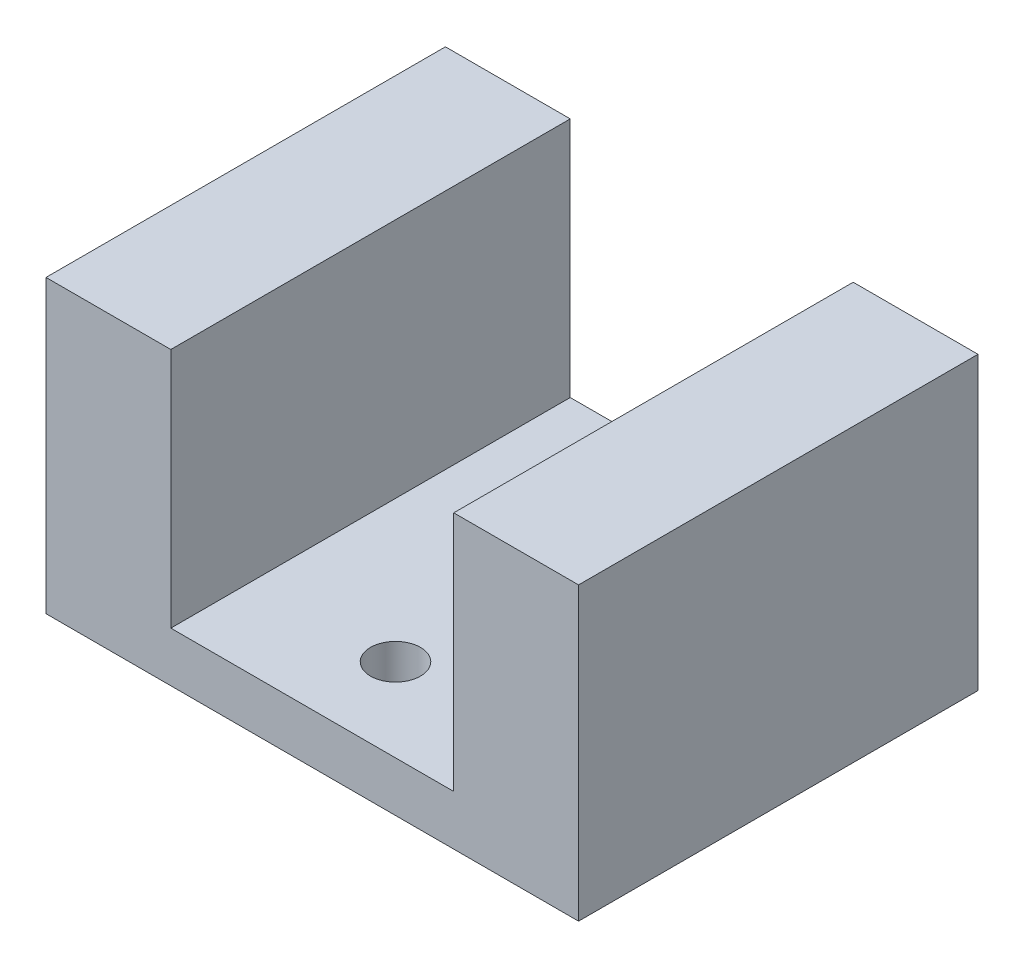
ISO-10303-21;
HEADER;
FILE_DESCRIPTION(('STEP AP214'),'2;1');
FILE_NAME('part.step','',(''),(''),'','','');
FILE_SCHEMA(('AUTOMOTIVE_DESIGN { 1 0 10303 214 1 1 1 1 }'));
ENDSEC;
DATA;
#1=APPLICATION_CONTEXT('core data for automotive mechanical design processes');
#2=APPLICATION_PROTOCOL_DEFINITION('international standard','automotive_design',2000,#1);
#3=PRODUCT_CONTEXT('',#1,'mechanical');
#4=PRODUCT('Part','Part','',(#3));
#5=PRODUCT_RELATED_PRODUCT_CATEGORY('part','',(#4));
#6=PRODUCT_DEFINITION_FORMATION('','',#4);
#7=PRODUCT_DEFINITION_CONTEXT('part definition',#1,'design');
#8=PRODUCT_DEFINITION('design','',#6,#7);
#9=PRODUCT_DEFINITION_SHAPE('','',#8);
#10=(LENGTH_UNIT() NAMED_UNIT(*) SI_UNIT(.MILLI.,.METRE.));
#11=(NAMED_UNIT(*) PLANE_ANGLE_UNIT() SI_UNIT($,.RADIAN.));
#12=(NAMED_UNIT(*) SI_UNIT($,.STERADIAN.) SOLID_ANGLE_UNIT());
#13=UNCERTAINTY_MEASURE_WITH_UNIT(LENGTH_MEASURE(1.E-05),#10,'distance_accuracy_value','');
#14=(GEOMETRIC_REPRESENTATION_CONTEXT(3) GLOBAL_UNCERTAINTY_ASSIGNED_CONTEXT((#13)) GLOBAL_UNIT_ASSIGNED_CONTEXT((#10,
#11,#12)) REPRESENTATION_CONTEXT('',''));
#15=CARTESIAN_POINT('',(0.,0.,0.));
#16=DIRECTION('',(0.,0.,1.));
#17=DIRECTION('',(1.,0.,0.));
#18=AXIS2_PLACEMENT_3D('',#15,#16,#17);
#19=CARTESIAN_POINT('',(-8.5,17.5,24.));
#20=DIRECTION('',(0.,-1.,0.));
#21=DIRECTION('',(1.,0.,0.));
#22=AXIS2_PLACEMENT_3D('',#19,#20,#21);
#23=PLANE('',#22);
#24=DIRECTION('',(-1.,0.,0.));
#25=VECTOR('',#24,1.);
#26=CARTESIAN_POINT('',(-8.5,17.5,0.));
#27=LINE('',#26,#25);
#28=CARTESIAN_POINT('',(-8.5,17.5,0.));
#29=VERTEX_POINT('',#28);
#30=CARTESIAN_POINT('',(-16.,17.5,0.));
#31=VERTEX_POINT('',#30);
#32=EDGE_CURVE('E129',#29,#31,#27,.T.);
#33=ORIENTED_EDGE('',*,*,#32,.T.);
#34=DIRECTION('',(0.,0.,-1.));
#35=VECTOR('',#34,1.);
#36=CARTESIAN_POINT('',(-16.,17.5,24.));
#37=LINE('',#36,#35);
#38=CARTESIAN_POINT('',(-16.,17.5,24.));
#39=VERTEX_POINT('',#38);
#40=EDGE_CURVE('E11',#39,#31,#37,.T.);
#41=ORIENTED_EDGE('',*,*,#40,.F.);
#42=DIRECTION('',(-1.,0.,0.));
#43=VECTOR('',#42,1.);
#44=CARTESIAN_POINT('',(-8.5,17.5,24.));
#45=LINE('',#44,#43);
#46=CARTESIAN_POINT('',(-8.5,17.5,24.));
#47=VERTEX_POINT('',#46);
#48=EDGE_CURVE('E144',#47,#39,#45,.T.);
#49=ORIENTED_EDGE('',*,*,#48,.F.);
#50=DIRECTION('',(0.,0.,-1.));
#51=VECTOR('',#50,1.);
#52=CARTESIAN_POINT('',(-8.5,17.5,24.));
#53=LINE('',#52,#51);
#54=EDGE_CURVE('E125',#47,#29,#53,.T.);
#55=ORIENTED_EDGE('',*,*,#54,.T.);
#56=EDGE_LOOP('',(#33,#41,#49,#55));
#57=FACE_BOUND('',#56,.T.);
#58=ADVANCED_FACE('F33',(#57),#23,.F.);
#59=CARTESIAN_POINT('',(-16.,17.5,24.));
#60=DIRECTION('',(1.,0.,0.));
#61=DIRECTION('',(0.,1.,0.));
#62=AXIS2_PLACEMENT_3D('',#59,#60,#61);
#63=PLANE('',#62);
#64=DIRECTION('',(0.,-1.,0.));
#65=VECTOR('',#64,1.);
#66=CARTESIAN_POINT('',(-16.,17.5,0.));
#67=LINE('',#66,#65);
#68=CARTESIAN_POINT('',(-16.,0.,0.));
#69=VERTEX_POINT('',#68);
#70=EDGE_CURVE('E132',#31,#69,#67,.T.);
#71=ORIENTED_EDGE('',*,*,#70,.T.);
#72=DIRECTION('',(0.,0.,-1.));
#73=VECTOR('',#72,1.);
#74=CARTESIAN_POINT('',(-16.,0.,24.));
#75=LINE('',#74,#73);
#76=CARTESIAN_POINT('',(-16.,0.,24.));
#77=VERTEX_POINT('',#76);
#78=EDGE_CURVE('E41',#77,#69,#75,.T.);
#79=ORIENTED_EDGE('',*,*,#78,.F.);
#80=DIRECTION('',(0.,-1.,0.));
#81=VECTOR('',#80,1.);
#82=CARTESIAN_POINT('',(-16.,17.5,24.));
#83=LINE('',#82,#81);
#84=EDGE_CURVE('E92',#39,#77,#83,.T.);
#85=ORIENTED_EDGE('',*,*,#84,.F.);
#86=ORIENTED_EDGE('',*,*,#40,.T.);
#87=EDGE_LOOP('',(#71,#79,#85,#86));
#88=FACE_BOUND('',#87,.T.);
#89=ADVANCED_FACE('F214',(#88),#63,.F.);
#90=CARTESIAN_POINT('',(-16.,0.,24.));
#91=DIRECTION('',(0.,1.,0.));
#92=DIRECTION('',(0.,0.,1.));
#93=AXIS2_PLACEMENT_3D('',#90,#91,#92);
#94=PLANE('',#93);
#95=CARTESIAN_POINT('',(0.,0.,5.));
#96=DIRECTION('',(0.,1.,0.));
#97=DIRECTION('',(0.,0.,1.));
#98=AXIS2_PLACEMENT_3D('',#95,#96,#97);
#99=CIRCLE('',#98,1.5);
#100=CARTESIAN_POINT('',(0.,0.,6.5));
#101=VERTEX_POINT('',#100);
#102=EDGE_CURVE('E133',#101,#101,#99,.F.);
#103=ORIENTED_EDGE('',*,*,#102,.F.);
#104=EDGE_LOOP('',(#103));
#105=FACE_BOUND('',#104,.T.);
#106=CARTESIAN_POINT('',(0.,0.,12.));
#107=DIRECTION('',(0.,1.,0.));
#108=DIRECTION('',(0.,0.,1.));
#109=AXIS2_PLACEMENT_3D('',#106,#107,#108);
#110=CIRCLE('',#109,2.05);
#111=CARTESIAN_POINT('',(0.,0.,14.05));
#112=VERTEX_POINT('',#111);
#113=EDGE_CURVE('E184',#112,#112,#110,.F.);
#114=ORIENTED_EDGE('',*,*,#113,.F.);
#115=EDGE_LOOP('',(#114));
#116=FACE_BOUND('',#115,.T.);
#117=CARTESIAN_POINT('',(0.,0.,19.));
#118=DIRECTION('',(0.,1.,0.));
#119=DIRECTION('',(0.,0.,1.));
#120=AXIS2_PLACEMENT_3D('',#117,#118,#119);
#121=CIRCLE('',#120,1.5);
#122=CARTESIAN_POINT('',(0.,0.,20.5));
#123=VERTEX_POINT('',#122);
#124=EDGE_CURVE('E177',#123,#123,#121,.F.);
#125=ORIENTED_EDGE('',*,*,#124,.F.);
#126=EDGE_LOOP('',(#125));
#127=FACE_BOUND('',#126,.T.);
#128=DIRECTION('',(1.,0.,0.));
#129=VECTOR('',#128,1.);
#130=CARTESIAN_POINT('',(-16.,0.,0.));
#131=LINE('',#130,#129);
#132=CARTESIAN_POINT('',(16.,0.,0.));
#133=VERTEX_POINT('',#132);
#134=EDGE_CURVE('E135',#69,#133,#131,.T.);
#135=ORIENTED_EDGE('',*,*,#134,.T.);
#136=DIRECTION('',(0.,0.,-1.));
#137=VECTOR('',#136,1.);
#138=CARTESIAN_POINT('',(16.,0.,24.));
#139=LINE('',#138,#137);
#140=CARTESIAN_POINT('',(16.,0.,24.));
#141=VERTEX_POINT('',#140);
#142=EDGE_CURVE('E151',#141,#133,#139,.T.);
#143=ORIENTED_EDGE('',*,*,#142,.F.);
#144=DIRECTION('',(1.,0.,0.));
#145=VECTOR('',#144,1.);
#146=CARTESIAN_POINT('',(-16.,0.,24.));
#147=LINE('',#146,#145);
#148=EDGE_CURVE('E159',#77,#141,#147,.T.);
#149=ORIENTED_EDGE('',*,*,#148,.F.);
#150=ORIENTED_EDGE('',*,*,#78,.T.);
#151=EDGE_LOOP('',(#135,#143,#149,#150));
#152=FACE_BOUND('',#151,.T.);
#153=ADVANCED_FACE('F157',(#105,#116,#127,#152),#94,.F.);
#154=CARTESIAN_POINT('',(16.,0.,24.));
#155=DIRECTION('',(-1.,0.,0.));
#156=DIRECTION('',(0.,-1.,0.));
#157=AXIS2_PLACEMENT_3D('',#154,#155,#156);
#158=PLANE('',#157);
#159=DIRECTION('',(0.,1.,0.));
#160=VECTOR('',#159,1.);
#161=CARTESIAN_POINT('',(16.,0.,0.));
#162=LINE('',#161,#160);
#163=CARTESIAN_POINT('',(16.,17.5,0.));
#164=VERTEX_POINT('',#163);
#165=EDGE_CURVE('E137',#133,#164,#162,.T.);
#166=ORIENTED_EDGE('',*,*,#165,.T.);
#167=DIRECTION('',(0.,0.,-1.));
#168=VECTOR('',#167,1.);
#169=CARTESIAN_POINT('',(16.,17.5,24.));
#170=LINE('',#169,#168);
#171=CARTESIAN_POINT('',(16.,17.5,24.));
#172=VERTEX_POINT('',#171);
#173=EDGE_CURVE('E148',#172,#164,#170,.T.);
#174=ORIENTED_EDGE('',*,*,#173,.F.);
#175=DIRECTION('',(0.,1.,0.));
#176=VECTOR('',#175,1.);
#177=CARTESIAN_POINT('',(16.,0.,24.));
#178=LINE('',#177,#176);
#179=EDGE_CURVE('E171',#141,#172,#178,.T.);
#180=ORIENTED_EDGE('',*,*,#179,.F.);
#181=ORIENTED_EDGE('',*,*,#142,.T.);
#182=EDGE_LOOP('',(#166,#174,#180,#181));
#183=FACE_BOUND('',#182,.T.);
#184=ADVANCED_FACE('F167',(#183),#158,.F.);
#185=CARTESIAN_POINT('',(16.,17.5,24.));
#186=DIRECTION('',(0.,-1.,0.));
#187=DIRECTION('',(0.,0.,-1.));
#188=AXIS2_PLACEMENT_3D('',#185,#186,#187);
#189=PLANE('',#188);
#190=DIRECTION('',(-1.,0.,0.));
#191=VECTOR('',#190,1.);
#192=CARTESIAN_POINT('',(16.,17.5,0.));
#193=LINE('',#192,#191);
#194=CARTESIAN_POINT('',(8.5,17.5,0.));
#195=VERTEX_POINT('',#194);
#196=EDGE_CURVE('E139',#164,#195,#193,.T.);
#197=ORIENTED_EDGE('',*,*,#196,.T.);
#198=DIRECTION('',(0.,0.,-1.));
#199=VECTOR('',#198,1.);
#200=CARTESIAN_POINT('',(8.5,17.5,24.));
#201=LINE('',#200,#199);
#202=CARTESIAN_POINT('',(8.5,17.5,24.));
#203=VERTEX_POINT('',#202);
#204=EDGE_CURVE('E120',#203,#195,#201,.T.);
#205=ORIENTED_EDGE('',*,*,#204,.F.);
#206=DIRECTION('',(-1.,0.,0.));
#207=VECTOR('',#206,1.);
#208=CARTESIAN_POINT('',(16.,17.5,24.));
#209=LINE('',#208,#207);
#210=EDGE_CURVE('E111',#172,#203,#209,.T.);
#211=ORIENTED_EDGE('',*,*,#210,.F.);
#212=ORIENTED_EDGE('',*,*,#173,.T.);
#213=EDGE_LOOP('',(#197,#205,#211,#212));
#214=FACE_BOUND('',#213,.T.);
#215=ADVANCED_FACE('F170',(#214),#189,.F.);
#216=CARTESIAN_POINT('',(8.5,17.5,24.));
#217=DIRECTION('',(1.,0.,0.));
#218=DIRECTION('',(0.,1.,0.));
#219=AXIS2_PLACEMENT_3D('',#216,#217,#218);
#220=PLANE('',#219);
#221=DIRECTION('',(0.,-1.,0.));
#222=VECTOR('',#221,1.);
#223=CARTESIAN_POINT('',(8.5,17.5,0.));
#224=LINE('',#223,#222);
#225=CARTESIAN_POINT('',(8.5,3.,0.));
#226=VERTEX_POINT('',#225);
#227=EDGE_CURVE('E119',#195,#226,#224,.T.);
#228=ORIENTED_EDGE('',*,*,#227,.T.);
#229=DIRECTION('',(0.,0.,-1.));
#230=VECTOR('',#229,1.);
#231=CARTESIAN_POINT('',(8.5,3.,24.));
#232=LINE('',#231,#230);
#233=CARTESIAN_POINT('',(8.5,3.,24.));
#234=VERTEX_POINT('',#233);
#235=EDGE_CURVE('E116',#234,#226,#232,.T.);
#236=ORIENTED_EDGE('',*,*,#235,.F.);
#237=DIRECTION('',(0.,-1.,0.));
#238=VECTOR('',#237,1.);
#239=CARTESIAN_POINT('',(8.5,17.5,24.));
#240=LINE('',#239,#238);
#241=EDGE_CURVE('E105',#203,#234,#240,.T.);
#242=ORIENTED_EDGE('',*,*,#241,.F.);
#243=ORIENTED_EDGE('',*,*,#204,.T.);
#244=EDGE_LOOP('',(#228,#236,#242,#243));
#245=FACE_BOUND('',#244,.T.);
#246=ADVANCED_FACE('F117',(#245),#220,.F.);
#247=CARTESIAN_POINT('',(8.5,3.,24.));
#248=DIRECTION('',(0.,-1.,0.));
#249=DIRECTION('',(1.,0.,0.));
#250=AXIS2_PLACEMENT_3D('',#247,#248,#249);
#251=PLANE('',#250);
#252=CARTESIAN_POINT('',(0.,3.,5.));
#253=DIRECTION('',(0.,1.,0.));
#254=DIRECTION('',(-1.,0.,0.));
#255=AXIS2_PLACEMENT_3D('',#252,#253,#254);
#256=CIRCLE('',#255,1.5);
#257=CARTESIAN_POINT('',(-1.5,3.,5.));
#258=VERTEX_POINT('',#257);
#259=EDGE_CURVE('E187',#258,#258,#256,.T.);
#260=ORIENTED_EDGE('',*,*,#259,.F.);
#261=EDGE_LOOP('',(#260));
#262=FACE_BOUND('',#261,.T.);
#263=CARTESIAN_POINT('',(0.,3.,12.));
#264=DIRECTION('',(0.,1.,0.));
#265=DIRECTION('',(-1.,0.,0.));
#266=AXIS2_PLACEMENT_3D('',#263,#264,#265);
#267=CIRCLE('',#266,2.05);
#268=CARTESIAN_POINT('',(-2.05,3.,12.));
#269=VERTEX_POINT('',#268);
#270=EDGE_CURVE('E180',#269,#269,#267,.T.);
#271=ORIENTED_EDGE('',*,*,#270,.F.);
#272=EDGE_LOOP('',(#271));
#273=FACE_BOUND('',#272,.T.);
#274=CARTESIAN_POINT('',(0.,3.,19.));
#275=DIRECTION('',(0.,1.,0.));
#276=DIRECTION('',(-1.,0.,0.));
#277=AXIS2_PLACEMENT_3D('',#274,#275,#276);
#278=CIRCLE('',#277,1.5);
#279=CARTESIAN_POINT('',(-1.5,3.,19.));
#280=VERTEX_POINT('',#279);
#281=EDGE_CURVE('E181',#280,#280,#278,.T.);
#282=ORIENTED_EDGE('',*,*,#281,.F.);
#283=EDGE_LOOP('',(#282));
#284=FACE_BOUND('',#283,.T.);
#285=DIRECTION('',(-1.,0.,0.));
#286=VECTOR('',#285,1.);
#287=CARTESIAN_POINT('',(8.5,3.,0.));
#288=LINE('',#287,#286);
#289=CARTESIAN_POINT('',(-8.5,3.,0.));
#290=VERTEX_POINT('',#289);
#291=EDGE_CURVE('E78',#226,#290,#288,.T.);
#292=ORIENTED_EDGE('',*,*,#291,.T.);
#293=DIRECTION('',(0.,0.,-1.));
#294=VECTOR('',#293,1.);
#295=CARTESIAN_POINT('',(-8.5,3.,24.));
#296=LINE('',#295,#294);
#297=CARTESIAN_POINT('',(-8.5,3.,24.));
#298=VERTEX_POINT('',#297);
#299=EDGE_CURVE('E121',#298,#290,#296,.T.);
#300=ORIENTED_EDGE('',*,*,#299,.F.);
#301=DIRECTION('',(-1.,0.,0.));
#302=VECTOR('',#301,1.);
#303=CARTESIAN_POINT('',(8.5,3.,24.));
#304=LINE('',#303,#302);
#305=EDGE_CURVE('E109',#234,#298,#304,.T.);
#306=ORIENTED_EDGE('',*,*,#305,.F.);
#307=ORIENTED_EDGE('',*,*,#235,.T.);
#308=EDGE_LOOP('',(#292,#300,#306,#307));
#309=FACE_BOUND('',#308,.T.);
#310=ADVANCED_FACE('F123',(#262,#273,#284,#309),#251,.F.);
#311=CARTESIAN_POINT('',(-8.5,3.,24.));
#312=DIRECTION('',(-1.,0.,0.));
#313=DIRECTION('',(0.,0.,1.));
#314=AXIS2_PLACEMENT_3D('',#311,#312,#313);
#315=PLANE('',#314);
#316=DIRECTION('',(0.,1.,0.));
#317=VECTOR('',#316,1.);
#318=CARTESIAN_POINT('',(-8.5,3.,0.));
#319=LINE('',#318,#317);
#320=EDGE_CURVE('E84',#290,#29,#319,.T.);
#321=ORIENTED_EDGE('',*,*,#320,.T.);
#322=ORIENTED_EDGE('',*,*,#54,.F.);
#323=DIRECTION('',(0.,1.,0.));
#324=VECTOR('',#323,1.);
#325=CARTESIAN_POINT('',(-8.5,3.,24.));
#326=LINE('',#325,#324);
#327=EDGE_CURVE('E49',#298,#47,#326,.T.);
#328=ORIENTED_EDGE('',*,*,#327,.F.);
#329=ORIENTED_EDGE('',*,*,#299,.T.);
#330=EDGE_LOOP('',(#321,#322,#328,#329));
#331=FACE_BOUND('',#330,.T.);
#332=ADVANCED_FACE('F200',(#331),#315,.F.);
#333=CARTESIAN_POINT('',(0.,0.,24.));
#334=DIRECTION('',(0.,0.,1.));
#335=DIRECTION('',(1.,0.,0.));
#336=AXIS2_PLACEMENT_3D('',#333,#334,#335);
#337=PLANE('',#336);
#338=ORIENTED_EDGE('',*,*,#48,.T.);
#339=ORIENTED_EDGE('',*,*,#84,.T.);
#340=ORIENTED_EDGE('',*,*,#148,.T.);
#341=ORIENTED_EDGE('',*,*,#179,.T.);
#342=ORIENTED_EDGE('',*,*,#210,.T.);
#343=ORIENTED_EDGE('',*,*,#241,.T.);
#344=ORIENTED_EDGE('',*,*,#305,.T.);
#345=ORIENTED_EDGE('',*,*,#327,.T.);
#346=EDGE_LOOP('',(#338,#339,#340,#341,#342,#343,#344,#345));
#347=FACE_BOUND('',#346,.T.);
#348=ADVANCED_FACE('F107',(#347),#337,.T.);
#349=CARTESIAN_POINT('',(0.,0.,0.));
#350=DIRECTION('',(0.,0.,1.));
#351=DIRECTION('',(1.,0.,0.));
#352=AXIS2_PLACEMENT_3D('',#349,#350,#351);
#353=PLANE('',#352);
#354=ORIENTED_EDGE('',*,*,#32,.F.);
#355=ORIENTED_EDGE('',*,*,#320,.F.);
#356=ORIENTED_EDGE('',*,*,#291,.F.);
#357=ORIENTED_EDGE('',*,*,#227,.F.);
#358=ORIENTED_EDGE('',*,*,#196,.F.);
#359=ORIENTED_EDGE('',*,*,#165,.F.);
#360=ORIENTED_EDGE('',*,*,#134,.F.);
#361=ORIENTED_EDGE('',*,*,#70,.F.);
#362=EDGE_LOOP('',(#354,#355,#356,#357,#358,#359,#360,#361));
#363=FACE_BOUND('',#362,.T.);
#364=ADVANCED_FACE('F163',(#363),#353,.F.);
#365=CARTESIAN_POINT('',(0.,-0.00100000000000273,19.));
#366=DIRECTION('',(0.,1.,0.));
#367=DIRECTION('',(-1.,0.,0.));
#368=AXIS2_PLACEMENT_3D('',#365,#366,#367);
#369=CYLINDRICAL_SURFACE('',#368,1.5);
#370=ORIENTED_EDGE('',*,*,#281,.T.);
#371=EDGE_LOOP('',(#370));
#372=FACE_BOUND('',#371,.T.);
#373=ORIENTED_EDGE('',*,*,#124,.T.);
#374=EDGE_LOOP('',(#373));
#375=FACE_BOUND('',#374,.T.);
#376=ADVANCED_FACE('F206',(#372,#375),#369,.F.);
#377=CARTESIAN_POINT('',(0.,-0.00100000000000273,12.));
#378=DIRECTION('',(0.,1.,0.));
#379=DIRECTION('',(-1.,0.,0.));
#380=AXIS2_PLACEMENT_3D('',#377,#378,#379);
#381=CYLINDRICAL_SURFACE('',#380,2.05);
#382=ORIENTED_EDGE('',*,*,#270,.T.);
#383=EDGE_LOOP('',(#382));
#384=FACE_BOUND('',#383,.T.);
#385=ORIENTED_EDGE('',*,*,#113,.T.);
#386=EDGE_LOOP('',(#385));
#387=FACE_BOUND('',#386,.T.);
#388=ADVANCED_FACE('F209',(#384,#387),#381,.F.);
#389=CARTESIAN_POINT('',(0.,-0.00100000000000273,5.));
#390=DIRECTION('',(0.,1.,0.));
#391=DIRECTION('',(-1.,0.,0.));
#392=AXIS2_PLACEMENT_3D('',#389,#390,#391);
#393=CYLINDRICAL_SURFACE('',#392,1.5);
#394=ORIENTED_EDGE('',*,*,#259,.T.);
#395=EDGE_LOOP('',(#394));
#396=FACE_BOUND('',#395,.T.);
#397=ORIENTED_EDGE('',*,*,#102,.T.);
#398=EDGE_LOOP('',(#397));
#399=FACE_BOUND('',#398,.T.);
#400=ADVANCED_FACE('F195',(#396,#399),#393,.F.);
#401=CLOSED_SHELL('',(#58,#89,#153,#184,#215,#246,#310,#332,#348,#364,#376,#388,#400));
#402=MANIFOLD_SOLID_BREP('B2',#401);
#403=ADVANCED_BREP_SHAPE_REPRESENTATION('',(#18,#402),#14);
#404=SHAPE_DEFINITION_REPRESENTATION(#9,#403);
ENDSEC;
END-ISO-10303-21;
